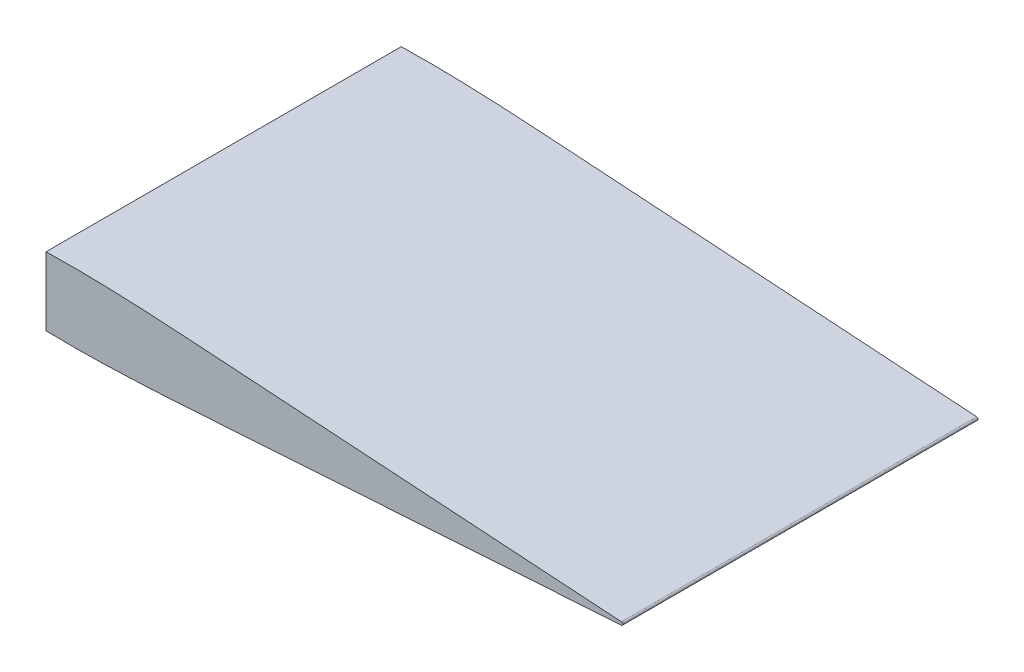
ISO-10303-21;
HEADER;
FILE_DESCRIPTION(('STEP AP214'),'2;1');
FILE_NAME('part.step','',(''),(''),'','','');
FILE_SCHEMA(('AUTOMOTIVE_DESIGN { 1 0 10303 214 1 1 1 1 }'));
ENDSEC;
DATA;
#1=APPLICATION_CONTEXT('core data for automotive mechanical design processes');
#2=APPLICATION_PROTOCOL_DEFINITION('international standard','automotive_design',2000,#1);
#3=PRODUCT_CONTEXT('',#1,'mechanical');
#4=PRODUCT('Part','Part','',(#3));
#5=PRODUCT_RELATED_PRODUCT_CATEGORY('part','',(#4));
#6=PRODUCT_DEFINITION_FORMATION('','',#4);
#7=PRODUCT_DEFINITION_CONTEXT('part definition',#1,'design');
#8=PRODUCT_DEFINITION('design','',#6,#7);
#9=PRODUCT_DEFINITION_SHAPE('','',#8);
#10=(LENGTH_UNIT() NAMED_UNIT(*) SI_UNIT(.MILLI.,.METRE.));
#11=(NAMED_UNIT(*) PLANE_ANGLE_UNIT() SI_UNIT($,.RADIAN.));
#12=(NAMED_UNIT(*) SI_UNIT($,.STERADIAN.) SOLID_ANGLE_UNIT());
#13=UNCERTAINTY_MEASURE_WITH_UNIT(LENGTH_MEASURE(1.E-05),#10,'distance_accuracy_value','');
#14=(GEOMETRIC_REPRESENTATION_CONTEXT(3) GLOBAL_UNCERTAINTY_ASSIGNED_CONTEXT((#13)) GLOBAL_UNIT_ASSIGNED_CONTEXT((#10,
#11,#12)) REPRESENTATION_CONTEXT('',''));
#15=CARTESIAN_POINT('',(0.,0.,0.));
#16=DIRECTION('',(0.,0.,1.));
#17=DIRECTION('',(1.,0.,0.));
#18=AXIS2_PLACEMENT_3D('',#15,#16,#17);
#19=CARTESIAN_POINT('',(57.0220913024489,21.1208734965673,-0.01000000000001));
#20=DIRECTION('',(-1.,0.,0.));
#21=DIRECTION('',(0.,0.,1.));
#22=AXIS2_PLACEMENT_3D('',#19,#20,#21);
#23=PLANE('',#22);
#24=DIRECTION('',(0.,-1.,0.));
#25=VECTOR('',#24,1.);
#26=CARTESIAN_POINT('',(57.0220913024489,-13.4640370754688,40.));
#27=LINE('',#26,#25);
#28=CARTESIAN_POINT('',(57.0220913024489,13.5359629245312,40.));
#29=VERTEX_POINT('',#28);
#30=CARTESIAN_POINT('',(57.0220913024489,-13.4640370754688,40.));
#31=VERTEX_POINT('',#30);
#32=EDGE_CURVE('E59',#29,#31,#27,.T.);
#33=ORIENTED_EDGE('',*,*,#32,.F.);
#34=DIRECTION('',(0.,0.,-1.));
#35=VECTOR('',#34,1.);
#36=CARTESIAN_POINT('',(57.0220913024489,13.5359629245312,40.));
#37=LINE('',#36,#35);
#38=CARTESIAN_POINT('',(57.0220913024489,13.5359629245312,110.));
#39=VERTEX_POINT('',#38);
#40=EDGE_CURVE('E201',#39,#29,#37,.T.);
#41=ORIENTED_EDGE('',*,*,#40,.F.);
#42=DIRECTION('',(0.,1.,0.));
#43=VECTOR('',#42,1.);
#44=CARTESIAN_POINT('',(57.0220913024489,-13.4640370754688,110.));
#45=LINE('',#44,#43);
#46=CARTESIAN_POINT('',(57.0220913024489,-13.4640370754688,110.));
#47=VERTEX_POINT('',#46);
#48=EDGE_CURVE('E205',#47,#39,#45,.T.);
#49=ORIENTED_EDGE('',*,*,#48,.F.);
#50=DIRECTION('',(0.,0.,1.));
#51=VECTOR('',#50,1.);
#52=CARTESIAN_POINT('',(57.0220913024489,-13.4640370754688,40.));
#53=LINE('',#52,#51);
#54=EDGE_CURVE('E214',#31,#47,#53,.T.);
#55=ORIENTED_EDGE('',*,*,#54,.F.);
#56=EDGE_LOOP('',(#33,#41,#49,#55));
#57=FACE_BOUND('',#56,.T.);
#58=DIRECTION('',(0.,-1.,0.));
#59=VECTOR('',#58,1.);
#60=CARTESIAN_POINT('',(57.0220913024489,2.03901631355602E-13,150.));
#61=LINE('',#60,#59);
#62=CARTESIAN_POINT('',(57.0220913112976,14.4496162845772,150.));
#63=VERTEX_POINT('',#62);
#64=CARTESIAN_POINT('',(57.0220913112977,-14.4496162845772,150.));
#65=VERTEX_POINT('',#64);
#66=EDGE_CURVE('E87',#63,#65,#61,.T.);
#67=ORIENTED_EDGE('',*,*,#66,.F.);
#68=DIRECTION('',(0.,0.,-1.));
#69=VECTOR('',#68,1.);
#70=CARTESIAN_POINT('',(57.0220913024489,14.4496162843662,150.));
#71=LINE('',#70,#69);
#72=CARTESIAN_POINT('',(57.0220913112976,14.4496162845772,0.));
#73=VERTEX_POINT('',#72);
#74=EDGE_CURVE('E108',#63,#73,#71,.T.);
#75=ORIENTED_EDGE('',*,*,#74,.T.);
#76=DIRECTION('',(0.,-1.,0.));
#77=VECTOR('',#76,1.);
#78=CARTESIAN_POINT('',(57.0220913024489,2.03901631355602E-13,0.));
#79=LINE('',#78,#77);
#80=CARTESIAN_POINT('',(57.0220913112977,-14.4496162845772,0.));
#81=VERTEX_POINT('',#80);
#82=EDGE_CURVE('E141',#73,#81,#79,.T.);
#83=ORIENTED_EDGE('',*,*,#82,.T.);
#84=DIRECTION('',(0.,0.,-1.));
#85=VECTOR('',#84,1.);
#86=CARTESIAN_POINT('',(57.0220913024489,-14.4496162843662,150.));
#87=LINE('',#86,#85);
#88=EDGE_CURVE('E149',#81,#65,#87,.F.);
#89=ORIENTED_EDGE('',*,*,#88,.T.);
#90=EDGE_LOOP('',(#67,#75,#83,#89));
#91=FACE_BOUND('',#90,.T.);
#92=ADVANCED_FACE('F41',(#57,#91),#23,.T.);
#93=CARTESIAN_POINT('',(300.,0.615,150.));
#94=CARTESIAN_POINT('',(297.904984083785,0.75175754308859,150.));
#95=CARTESIAN_POINT('',(292.317834146917,1.11647310076999,150.));
#96=CARTESIAN_POINT('',(283.239167485548,1.717548993117,150.));
#97=CARTESIAN_POINT('',(272.76385107331,2.40173412883395,150.));
#98=CARTESIAN_POINT('',(262.289009769235,3.09314837150869,150.));
#99=CARTESIAN_POINT('',(251.814135815064,3.78406655140474,150.));
#100=CARTESIAN_POINT('',(241.337843931188,4.46862529985887,150.));
#101=CARTESIAN_POINT('',(230.862161265605,5.16145375899976,150.));
#102=CARTESIAN_POINT('',(220.385838201456,5.84553816170969,150.));
#103=CARTESIAN_POINT('',(209.911154414138,6.53834924156426,150.));
#104=CARTESIAN_POINT('',(199.435845553229,7.22265025326787,150.));
#105=CARTESIAN_POINT('',(188.961161961777,7.91546436518573,150.));
#106=CARTESIAN_POINT('',(178.484838114123,8.59953663901671,150.));
#107=CARTESIAN_POINT('',(168.010154067309,9.29234472619852,150.));
#108=CARTESIAN_POINT('',(157.534847027507,9.97666983236351,150.));
#109=CARTESIAN_POINT('',(147.06015640951,10.6693905377389,150.));
#110=CARTESIAN_POINT('',(136.583858847943,11.3538123568298,150.));
#111=CARTESIAN_POINT('',(126.108081002565,12.0453815229781,150.));
#112=CARTESIAN_POINT('',(115.628989204461,12.7348475775842,150.));
#113=CARTESIAN_POINT('',(106.544413863488,13.3187717638727,150.));
#114=CARTESIAN_POINT('',(98.151476206991,13.7592616634662,150.));
#115=CARTESIAN_POINT('',(91.1565623688358,14.0750535449349,150.));
#116=CARTESIAN_POINT('',(83.4590911030426,14.3326710084469,150.));
#117=CARTESIAN_POINT('',(76.8097627687469,14.4942663264378,150.));
#118=CARTESIAN_POINT('',(71.208103954924,14.5530438963208,150.));
#119=CARTESIAN_POINT('',(68.0570107705436,14.5648415354949,150.));
#120=CARTESIAN_POINT('',(65.9559846118634,14.5661361460291,150.));
#121=CARTESIAN_POINT('',(63.5049428575731,14.5483076615896,150.));
#122=CARTESIAN_POINT('',(58.9501852432483,14.5072274097355,150.));
#123=CARTESIAN_POINT('',(52.6393729328738,14.3421780252763,150.));
#124=CARTESIAN_POINT('',(45.9763950033585,14.0411696911552,150.));
#125=CARTESIAN_POINT('',(40.7142788662388,13.6942708963401,150.));
#126=CARTESIAN_POINT('',(36.8531486122309,13.3715858694841,150.));
#127=CARTESIAN_POINT('',(33.6905280026766,13.0667563353647,150.));
#128=CARTESIAN_POINT('',(30.5256864431676,12.7135928826588,150.));
#129=CARTESIAN_POINT('',(27.3574246256501,12.304603807145,150.));
#130=CARTESIAN_POINT('',(23.8293477768756,11.7731450606675,150.));
#131=CARTESIAN_POINT('',(20.2934490427705,11.1558108117877,150.));
#132=CARTESIAN_POINT('',(16.7526134925339,10.4050388087684,150.));
#133=CARTESIAN_POINT('',(13.9101456800867,9.69526837778904,150.));
#134=CARTESIAN_POINT('',(11.411898728501,8.96894267593932,150.));
#135=CARTESIAN_POINT('',(9.247069544107,8.23912232844403,150.));
#136=CARTESIAN_POINT('',(7.0471016636079,7.37156353291515,150.));
#137=CARTESIAN_POINT('',(5.20436825337569,6.46929823591286,150.));
#138=CARTESIAN_POINT('',(3.70440686726622,5.56696021824286,150.));
#139=CARTESIAN_POINT('',(2.49240630636274,4.6717641181702,150.));
#140=CARTESIAN_POINT('',(0.823776107687222,3.08438944362807,150.));
#141=CARTESIAN_POINT('',(-0.563560510684523,0.,150.));
#142=CARTESIAN_POINT('',(0.823776107687273,-3.08438944362815,150.));
#143=CARTESIAN_POINT('',(2.49240630636272,-4.67176411817019,150.));
#144=CARTESIAN_POINT('',(3.70440686726622,-5.56696021824286,150.));
#145=CARTESIAN_POINT('',(5.20436825337569,-6.46929823591286,150.));
#146=CARTESIAN_POINT('',(7.04710166360792,-7.37156353291516,150.));
#147=CARTESIAN_POINT('',(9.24706954410698,-8.23912232844402,150.));
#148=CARTESIAN_POINT('',(11.411898728501,-8.96894267593932,150.));
#149=CARTESIAN_POINT('',(13.9101456800867,-9.69526837778906,150.));
#150=CARTESIAN_POINT('',(16.7526134925338,-10.4050388087684,150.));
#151=CARTESIAN_POINT('',(20.2934490427705,-11.1558108117877,150.));
#152=CARTESIAN_POINT('',(23.8293477768757,-11.7731450606675,150.));
#153=CARTESIAN_POINT('',(27.35742462565,-12.304603807145,150.));
#154=CARTESIAN_POINT('',(30.5256864431676,-12.7135928826588,150.));
#155=CARTESIAN_POINT('',(33.6905280026766,-13.0667563353647,150.));
#156=CARTESIAN_POINT('',(36.8531486122309,-13.3715858694841,150.));
#157=CARTESIAN_POINT('',(40.7142788662388,-13.6942708963401,150.));
#158=CARTESIAN_POINT('',(45.9763950033586,-14.0411696911552,150.));
#159=CARTESIAN_POINT('',(52.6393729328738,-14.3421780252763,150.));
#160=CARTESIAN_POINT('',(58.9501852432483,-14.5072274097355,150.));
#161=CARTESIAN_POINT('',(63.5049428575731,-14.5483076615896,150.));
#162=CARTESIAN_POINT('',(65.9559846118633,-14.5661361460291,150.));
#163=CARTESIAN_POINT('',(68.0570107705436,-14.5648415354949,150.));
#164=CARTESIAN_POINT('',(71.208103954924,-14.5530438963208,150.));
#165=CARTESIAN_POINT('',(76.8097627687469,-14.4942663264378,150.));
#166=CARTESIAN_POINT('',(83.4590911030426,-14.3326710084469,150.));
#167=CARTESIAN_POINT('',(91.1565623688358,-14.0750535449349,150.));
#168=CARTESIAN_POINT('',(98.151476206991,-13.7592616634662,150.));
#169=CARTESIAN_POINT('',(106.544413863488,-13.3187717638727,150.));
#170=CARTESIAN_POINT('',(115.628989204461,-12.7348475775842,150.));
#171=CARTESIAN_POINT('',(126.108081002565,-12.0453815229782,150.));
#172=CARTESIAN_POINT('',(136.583858847943,-11.3538123568298,150.));
#173=CARTESIAN_POINT('',(147.06015640951,-10.6693905377389,150.));
#174=CARTESIAN_POINT('',(157.534847027507,-9.97666983236352,150.));
#175=CARTESIAN_POINT('',(168.010154067309,-9.29234472619851,150.));
#176=CARTESIAN_POINT('',(178.484838114123,-8.59953663901672,150.));
#177=CARTESIAN_POINT('',(188.961161961777,-7.91546436518573,150.));
#178=CARTESIAN_POINT('',(199.435845553229,-7.22265025326786,150.));
#179=CARTESIAN_POINT('',(209.911154414138,-6.53834924156426,150.));
#180=CARTESIAN_POINT('',(220.385838201456,-5.84553816170969,150.));
#181=CARTESIAN_POINT('',(230.862161265605,-5.16145375899976,150.));
#182=CARTESIAN_POINT('',(241.337843931188,-4.46862529985887,150.));
#183=CARTESIAN_POINT('',(251.814135815064,-3.78406655140474,150.));
#184=CARTESIAN_POINT('',(262.289009769236,-3.09314837150869,150.));
#185=CARTESIAN_POINT('',(272.76385107331,-2.40173412883395,150.));
#186=CARTESIAN_POINT('',(283.239167485548,-1.71754899311699,150.));
#187=CARTESIAN_POINT('',(292.317834146917,-1.11647310077,150.));
#188=CARTESIAN_POINT('',(297.904984083785,-0.75175754308859,150.));
#189=CARTESIAN_POINT('',(300.,-0.615,150.));
#190=B_SPLINE_CURVE_WITH_KNOTS('',3,(#93,#94,#95,#96,#97,#98,#99,#100,#101,#102,#103,#104,#105,
#106,#107,#108,#109,#110,#111,#112,#113,#114,#115,#116,#117,#118,#119,#120,#121,#122,#123,#124,
#125,#126,#127,#128,#129,#130,#131,#132,#133,#134,#135,#136,#137,#138,#139,#140,#141,#142,#143,
#144,#145,#146,#147,#148,#149,#150,#151,#152,#153,#154,#155,#156,#157,#158,#159,#160,#161,#162,
#163,#164,#165,#166,#167,#168,#169,#170,#171,#172,#173,#174,#175,#176,#177,#178,#179,#180,#181,
#182,#183,#184,#185,#186,#187,#188,#189),.UNSPECIFIED.,.F.,.F.,(4,1,1,1,1,1,1,1,1,1,1,1,1,1,1,1,
1,1,1,1,1,1,1,1,1,1,1,1,1,1,1,1,1,1,1,1,1,1,1,1,1,1,1,1,1,1,1,1,1,1,1,1,1,1,1,1,1,1,1,1,1,1,1,1,
1,1,1,1,1,1,1,1,1,1,1,1,1,1,1,1,1,1,1,1,1,1,1,1,1,1,1,1,1,1,4),(0.,0.0103317667258092,
0.0275535519148415,0.0447750143759933,0.0619918890878921,0.0792136742769245,0.0964351367380763,
0.113656921927109,0.13087838438826,0.148100169577293,0.165316721469263,0.182538506658296,
0.199759969119447,0.21698175430848,0.23419830620045,0.251420091389483,0.268641553850634,
0.285863339039667,0.303084801500818,0.320322147091687,0.330661096781363,0.344443905301423,
0.354779243630488,0.368562091684667,0.377174559088726,0.382346693571461,0.384069085539591,
0.387513925716762,0.394408809862741,0.406484297575228,0.418578438098915,0.427229264414947,
0.432434171748687,0.437645263639366,0.442864528340028,0.448104781667718,0.453364927121588,
0.460421620890769,0.465764878525566,0.47117403778509,0.474835155867093,0.478565393973049,
0.482412614605373,0.486466494475071,0.488643966308192,0.49102188077919,0.493857902158305,0.5,
0.506142097841696,0.50897811922081,0.511356033691808,0.513533505524929,0.517587385394628,
0.521434606026952,0.525164844132907,0.52882596221491,0.534235121474435,0.539578379109231,
0.546635072878412,0.551895218332282,0.557135471659973,0.562354736360635,0.567565828251314,
0.572770735585054,0.581421561901085,0.593515702424773,0.605591190137259,0.612486074283239,
0.615930914460409,0.617653306428539,0.622825440911274,0.631437908315334,0.645220756369513,
0.655556094698577,0.669338903218637,0.679677852908314,0.696915198499182,0.714136660960334,
0.731358446149366,0.748579908610518,0.76580169379955,0.783018245691521,0.800240030880553,
0.817461493341705,0.834683278530737,0.851899830422708,0.86912161561174,0.886343078072892,
0.903564863261924,0.920786325723076,0.938008110912108,0.955224985624007,0.972446448085159,
0.989668233274191,1.),.UNSPECIFIED.);
#191=DIRECTION('',(0.,0.,-1.));
#192=VECTOR('',#191,1.);
#193=SURFACE_OF_LINEAR_EXTRUSION('',#190,#192);
#194=ORIENTED_EDGE('',*,*,#74,.F.);
#195=CARTESIAN_POINT('',(300.,0.615,150.));
#196=VERTEX_POINT('',#195);
#197=EDGE_CURVE('E91',#196,#63,#190,.T.);
#198=ORIENTED_EDGE('',*,*,#197,.F.);
#199=DIRECTION('',(0.,0.,-1.));
#200=VECTOR('',#199,1.);
#201=CARTESIAN_POINT('',(300.,0.615,150.));
#202=LINE('',#201,#200);
#203=CARTESIAN_POINT('',(300.,0.615,0.));
#204=VERTEX_POINT('',#203);
#205=EDGE_CURVE('E98',#196,#204,#202,.T.);
#206=ORIENTED_EDGE('',*,*,#205,.T.);
#207=CARTESIAN_POINT('',(300.,0.615,0.));
#208=CARTESIAN_POINT('',(297.904984083785,0.75175754308859,0.));
#209=CARTESIAN_POINT('',(292.317834146917,1.11647310076999,0.));
#210=CARTESIAN_POINT('',(283.239167485548,1.717548993117,0.));
#211=CARTESIAN_POINT('',(272.76385107331,2.40173412883395,0.));
#212=CARTESIAN_POINT('',(262.289009769235,3.09314837150869,0.));
#213=CARTESIAN_POINT('',(251.814135815064,3.78406655140474,0.));
#214=CARTESIAN_POINT('',(241.337843931188,4.46862529985887,0.));
#215=CARTESIAN_POINT('',(230.862161265605,5.16145375899976,0.));
#216=CARTESIAN_POINT('',(220.385838201456,5.84553816170969,0.));
#217=CARTESIAN_POINT('',(209.911154414138,6.53834924156426,0.));
#218=CARTESIAN_POINT('',(199.435845553229,7.22265025326787,0.));
#219=CARTESIAN_POINT('',(188.961161961777,7.91546436518573,0.));
#220=CARTESIAN_POINT('',(178.484838114123,8.59953663901671,0.));
#221=CARTESIAN_POINT('',(168.010154067309,9.29234472619852,0.));
#222=CARTESIAN_POINT('',(157.534847027507,9.97666983236351,0.));
#223=CARTESIAN_POINT('',(147.06015640951,10.6693905377389,0.));
#224=CARTESIAN_POINT('',(136.583858847943,11.3538123568298,0.));
#225=CARTESIAN_POINT('',(126.108081002565,12.0453815229781,0.));
#226=CARTESIAN_POINT('',(115.628989204461,12.7348475775842,0.));
#227=CARTESIAN_POINT('',(106.544413863488,13.3187717638727,0.));
#228=CARTESIAN_POINT('',(98.151476206991,13.7592616634662,0.));
#229=CARTESIAN_POINT('',(91.1565623688358,14.0750535449349,0.));
#230=CARTESIAN_POINT('',(83.4590911030426,14.3326710084469,0.));
#231=CARTESIAN_POINT('',(76.8097627687469,14.4942663264378,0.));
#232=CARTESIAN_POINT('',(71.208103954924,14.5530438963208,0.));
#233=CARTESIAN_POINT('',(68.0570107705436,14.5648415354949,0.));
#234=CARTESIAN_POINT('',(65.9559846118634,14.5661361460291,0.));
#235=CARTESIAN_POINT('',(63.5049428575731,14.5483076615896,0.));
#236=CARTESIAN_POINT('',(58.9501852432483,14.5072274097355,0.));
#237=CARTESIAN_POINT('',(52.6393729328738,14.3421780252763,0.));
#238=CARTESIAN_POINT('',(45.9763950033585,14.0411696911552,0.));
#239=CARTESIAN_POINT('',(40.7142788662388,13.6942708963401,0.));
#240=CARTESIAN_POINT('',(36.8531486122309,13.3715858694841,0.));
#241=CARTESIAN_POINT('',(33.6905280026766,13.0667563353647,0.));
#242=CARTESIAN_POINT('',(30.5256864431676,12.7135928826588,0.));
#243=CARTESIAN_POINT('',(27.3574246256501,12.304603807145,0.));
#244=CARTESIAN_POINT('',(23.8293477768756,11.7731450606675,0.));
#245=CARTESIAN_POINT('',(20.2934490427705,11.1558108117877,0.));
#246=CARTESIAN_POINT('',(16.7526134925339,10.4050388087684,0.));
#247=CARTESIAN_POINT('',(13.9101456800867,9.69526837778904,0.));
#248=CARTESIAN_POINT('',(11.411898728501,8.96894267593932,0.));
#249=CARTESIAN_POINT('',(9.247069544107,8.23912232844403,0.));
#250=CARTESIAN_POINT('',(7.0471016636079,7.37156353291515,0.));
#251=CARTESIAN_POINT('',(5.20436825337569,6.46929823591286,0.));
#252=CARTESIAN_POINT('',(3.70440686726622,5.56696021824286,0.));
#253=CARTESIAN_POINT('',(2.49240630636274,4.6717641181702,0.));
#254=CARTESIAN_POINT('',(0.823776107687222,3.08438944362807,0.));
#255=CARTESIAN_POINT('',(-0.563560510684523,0.,0.));
#256=CARTESIAN_POINT('',(0.823776107687273,-3.08438944362815,0.));
#257=CARTESIAN_POINT('',(2.49240630636272,-4.67176411817019,0.));
#258=CARTESIAN_POINT('',(3.70440686726622,-5.56696021824286,0.));
#259=CARTESIAN_POINT('',(5.20436825337569,-6.46929823591286,0.));
#260=CARTESIAN_POINT('',(7.04710166360792,-7.37156353291516,0.));
#261=CARTESIAN_POINT('',(9.24706954410698,-8.23912232844402,0.));
#262=CARTESIAN_POINT('',(11.411898728501,-8.96894267593932,0.));
#263=CARTESIAN_POINT('',(13.9101456800867,-9.69526837778906,0.));
#264=CARTESIAN_POINT('',(16.7526134925338,-10.4050388087684,0.));
#265=CARTESIAN_POINT('',(20.2934490427705,-11.1558108117877,0.));
#266=CARTESIAN_POINT('',(23.8293477768757,-11.7731450606675,0.));
#267=CARTESIAN_POINT('',(27.35742462565,-12.304603807145,0.));
#268=CARTESIAN_POINT('',(30.5256864431676,-12.7135928826588,0.));
#269=CARTESIAN_POINT('',(33.6905280026766,-13.0667563353647,0.));
#270=CARTESIAN_POINT('',(36.8531486122309,-13.3715858694841,0.));
#271=CARTESIAN_POINT('',(40.7142788662388,-13.6942708963401,0.));
#272=CARTESIAN_POINT('',(45.9763950033586,-14.0411696911552,0.));
#273=CARTESIAN_POINT('',(52.6393729328738,-14.3421780252763,0.));
#274=CARTESIAN_POINT('',(58.9501852432483,-14.5072274097355,0.));
#275=CARTESIAN_POINT('',(63.5049428575731,-14.5483076615896,0.));
#276=CARTESIAN_POINT('',(65.9559846118633,-14.5661361460291,0.));
#277=CARTESIAN_POINT('',(68.0570107705436,-14.5648415354949,0.));
#278=CARTESIAN_POINT('',(71.208103954924,-14.5530438963208,0.));
#279=CARTESIAN_POINT('',(76.8097627687469,-14.4942663264378,0.));
#280=CARTESIAN_POINT('',(83.4590911030426,-14.3326710084469,0.));
#281=CARTESIAN_POINT('',(91.1565623688358,-14.0750535449349,0.));
#282=CARTESIAN_POINT('',(98.151476206991,-13.7592616634662,0.));
#283=CARTESIAN_POINT('',(106.544413863488,-13.3187717638727,0.));
#284=CARTESIAN_POINT('',(115.628989204461,-12.7348475775842,0.));
#285=CARTESIAN_POINT('',(126.108081002565,-12.0453815229782,0.));
#286=CARTESIAN_POINT('',(136.583858847943,-11.3538123568298,0.));
#287=CARTESIAN_POINT('',(147.06015640951,-10.6693905377389,0.));
#288=CARTESIAN_POINT('',(157.534847027507,-9.97666983236352,0.));
#289=CARTESIAN_POINT('',(168.010154067309,-9.29234472619851,0.));
#290=CARTESIAN_POINT('',(178.484838114123,-8.59953663901672,0.));
#291=CARTESIAN_POINT('',(188.961161961777,-7.91546436518573,0.));
#292=CARTESIAN_POINT('',(199.435845553229,-7.22265025326786,0.));
#293=CARTESIAN_POINT('',(209.911154414138,-6.53834924156426,0.));
#294=CARTESIAN_POINT('',(220.385838201456,-5.84553816170969,0.));
#295=CARTESIAN_POINT('',(230.862161265605,-5.16145375899976,0.));
#296=CARTESIAN_POINT('',(241.337843931188,-4.46862529985887,0.));
#297=CARTESIAN_POINT('',(251.814135815064,-3.78406655140474,0.));
#298=CARTESIAN_POINT('',(262.289009769236,-3.09314837150869,0.));
#299=CARTESIAN_POINT('',(272.76385107331,-2.40173412883395,0.));
#300=CARTESIAN_POINT('',(283.239167485548,-1.71754899311699,0.));
#301=CARTESIAN_POINT('',(292.317834146917,-1.11647310077,0.));
#302=CARTESIAN_POINT('',(297.904984083785,-0.75175754308859,0.));
#303=CARTESIAN_POINT('',(300.,-0.615,0.));
#304=B_SPLINE_CURVE_WITH_KNOTS('',3,(#207,#208,#209,#210,#211,#212,#213,#214,#215,#216,#217,
#218,#219,#220,#221,#222,#223,#224,#225,#226,#227,#228,#229,#230,#231,#232,#233,#234,#235,#236,
#237,#238,#239,#240,#241,#242,#243,#244,#245,#246,#247,#248,#249,#250,#251,#252,#253,#254,#255,
#256,#257,#258,#259,#260,#261,#262,#263,#264,#265,#266,#267,#268,#269,#270,#271,#272,#273,#274,
#275,#276,#277,#278,#279,#280,#281,#282,#283,#284,#285,#286,#287,#288,#289,#290,#291,#292,#293,
#294,#295,#296,#297,#298,#299,#300,#301,#302,#303),.UNSPECIFIED.,.F.,.F.,(4,1,1,1,1,1,1,1,1,1,1,
1,1,1,1,1,1,1,1,1,1,1,1,1,1,1,1,1,1,1,1,1,1,1,1,1,1,1,1,1,1,1,1,1,1,1,1,1,1,1,1,1,1,1,1,1,1,1,1,
1,1,1,1,1,1,1,1,1,1,1,1,1,1,1,1,1,1,1,1,1,1,1,1,1,1,1,1,1,1,1,1,1,1,1,4),(0.,0.0103317667258092,
0.0275535519148415,0.0447750143759933,0.0619918890878921,0.0792136742769245,0.0964351367380763,
0.113656921927109,0.13087838438826,0.148100169577293,0.165316721469263,0.182538506658296,
0.199759969119447,0.21698175430848,0.23419830620045,0.251420091389483,0.268641553850634,
0.285863339039667,0.303084801500818,0.320322147091687,0.330661096781363,0.344443905301423,
0.354779243630488,0.368562091684667,0.377174559088726,0.382346693571461,0.384069085539591,
0.387513925716762,0.394408809862741,0.406484297575228,0.418578438098915,0.427229264414947,
0.432434171748687,0.437645263639366,0.442864528340028,0.448104781667718,0.453364927121588,
0.460421620890769,0.465764878525566,0.47117403778509,0.474835155867093,0.478565393973049,
0.482412614605373,0.486466494475071,0.488643966308192,0.49102188077919,0.493857902158305,0.5,
0.506142097841696,0.50897811922081,0.511356033691808,0.513533505524929,0.517587385394628,
0.521434606026952,0.525164844132907,0.52882596221491,0.534235121474435,0.539578379109231,
0.546635072878412,0.551895218332282,0.557135471659973,0.562354736360635,0.567565828251314,
0.572770735585054,0.581421561901085,0.593515702424773,0.605591190137259,0.612486074283239,
0.615930914460409,0.617653306428539,0.622825440911274,0.631437908315334,0.645220756369513,
0.655556094698577,0.669338903218637,0.679677852908314,0.696915198499182,0.714136660960334,
0.731358446149366,0.748579908610518,0.76580169379955,0.783018245691521,0.800240030880553,
0.817461493341705,0.834683278530737,0.851899830422708,0.86912161561174,0.886343078072892,
0.903564863261924,0.920786325723076,0.938008110912108,0.955224985624007,0.972446448085159,
0.989668233274191,1.),.UNSPECIFIED.);
#305=EDGE_CURVE('E45',#204,#73,#304,.T.);
#306=ORIENTED_EDGE('',*,*,#305,.T.);
#307=EDGE_LOOP('',(#194,#198,#206,#306));
#308=FACE_BOUND('',#307,.T.);
#309=ADVANCED_FACE('F124',(#308),#193,.F.);
#310=ORIENTED_EDGE('',*,*,#88,.F.);
#311=CARTESIAN_POINT('',(300.,-0.615,0.));
#312=VERTEX_POINT('',#311);
#313=EDGE_CURVE('E11',#81,#312,#304,.T.);
#314=ORIENTED_EDGE('',*,*,#313,.T.);
#315=DIRECTION('',(0.,0.,-1.));
#316=VECTOR('',#315,1.);
#317=CARTESIAN_POINT('',(300.,-0.615,150.));
#318=LINE('',#317,#316);
#319=CARTESIAN_POINT('',(300.,-0.615,150.));
#320=VERTEX_POINT('',#319);
#321=EDGE_CURVE('E96',#320,#312,#318,.T.);
#322=ORIENTED_EDGE('',*,*,#321,.F.);
#323=EDGE_CURVE('E80',#65,#320,#190,.T.);
#324=ORIENTED_EDGE('',*,*,#323,.F.);
#325=EDGE_LOOP('',(#310,#314,#322,#324));
#326=FACE_BOUND('',#325,.T.);
#327=ADVANCED_FACE('F102',(#326),#193,.F.);
#328=CARTESIAN_POINT('',(0.,2.03901631355602E-13,150.));
#329=DIRECTION('',(0.,0.,1.));
#330=DIRECTION('',(1.,0.,0.));
#331=AXIS2_PLACEMENT_3D('',#328,#329,#330);
#332=PLANE('',#331);
#333=ORIENTED_EDGE('',*,*,#197,.T.);
#334=ORIENTED_EDGE('',*,*,#66,.T.);
#335=ORIENTED_EDGE('',*,*,#323,.T.);
#336=CARTESIAN_POINT('',(299.959854295928,0.,150.));
#337=DIRECTION('',(0.,0.,1.));
#338=DIRECTION('',(-1.,0.,0.));
#339=AXIS2_PLACEMENT_3D('',#336,#337,#338);
#340=CIRCLE('',#339,0.616308914064589);
#341=EDGE_CURVE('E83',#320,#196,#340,.T.);
#342=ORIENTED_EDGE('',*,*,#341,.T.);
#343=EDGE_LOOP('',(#333,#334,#335,#342));
#344=FACE_BOUND('',#343,.T.);
#345=ADVANCED_FACE('F43',(#344),#332,.T.);
#346=CARTESIAN_POINT('',(0.,2.03901631355602E-13,0.));
#347=DIRECTION('',(0.,0.,1.));
#348=DIRECTION('',(1.,0.,0.));
#349=AXIS2_PLACEMENT_3D('',#346,#347,#348);
#350=PLANE('',#349);
#351=ORIENTED_EDGE('',*,*,#82,.F.);
#352=ORIENTED_EDGE('',*,*,#305,.F.);
#353=CARTESIAN_POINT('',(299.959854295928,0.,0.));
#354=DIRECTION('',(0.,0.,1.));
#355=DIRECTION('',(-1.,0.,0.));
#356=AXIS2_PLACEMENT_3D('',#353,#354,#355);
#357=CIRCLE('',#356,0.616308914064589);
#358=EDGE_CURVE('E90',#312,#204,#357,.T.);
#359=ORIENTED_EDGE('',*,*,#358,.F.);
#360=ORIENTED_EDGE('',*,*,#313,.F.);
#361=EDGE_LOOP('',(#351,#352,#359,#360));
#362=FACE_BOUND('',#361,.T.);
#363=ADVANCED_FACE('F129',(#362),#350,.F.);
#364=CARTESIAN_POINT('',(299.959854295928,0.,150.));
#365=DIRECTION('',(0.,0.,-1.));
#366=DIRECTION('',(-1.,0.,0.));
#367=AXIS2_PLACEMENT_3D('',#364,#365,#366);
#368=CYLINDRICAL_SURFACE('',#367,0.616308914064589);
#369=ORIENTED_EDGE('',*,*,#358,.T.);
#370=ORIENTED_EDGE('',*,*,#205,.F.);
#371=ORIENTED_EDGE('',*,*,#341,.F.);
#372=ORIENTED_EDGE('',*,*,#321,.T.);
#373=EDGE_LOOP('',(#369,#370,#371,#372));
#374=FACE_BOUND('',#373,.T.);
#375=ADVANCED_FACE('F95',(#374),#368,.T.);
#376=CARTESIAN_POINT('',(77.0220913024489,-13.4640370754688,40.));
#377=DIRECTION('',(0.,0.,-1.));
#378=DIRECTION('',(-1.,0.,0.));
#379=AXIS2_PLACEMENT_3D('',#376,#377,#378);
#380=PLANE('',#379);
#381=ORIENTED_EDGE('',*,*,#32,.T.);
#382=DIRECTION('',(-1.,0.,0.));
#383=VECTOR('',#382,1.);
#384=CARTESIAN_POINT('',(77.0220913024489,-13.4640370754688,40.));
#385=LINE('',#384,#383);
#386=CARTESIAN_POINT('',(77.0220913024489,-13.4640370754688,40.));
#387=VERTEX_POINT('',#386);
#388=EDGE_CURVE('E111',#387,#31,#385,.T.);
#389=ORIENTED_EDGE('',*,*,#388,.F.);
#390=DIRECTION('',(0.,-1.,0.));
#391=VECTOR('',#390,1.);
#392=CARTESIAN_POINT('',(77.0220913024489,-13.4640370754688,40.));
#393=LINE('',#392,#391);
#394=CARTESIAN_POINT('',(77.0220913024489,13.5359629245312,40.));
#395=VERTEX_POINT('',#394);
#396=EDGE_CURVE('E181',#395,#387,#393,.T.);
#397=ORIENTED_EDGE('',*,*,#396,.F.);
#398=DIRECTION('',(-1.,0.,0.));
#399=VECTOR('',#398,1.);
#400=CARTESIAN_POINT('',(77.0220913024489,13.5359629245312,40.));
#401=LINE('',#400,#399);
#402=EDGE_CURVE('E150',#395,#29,#401,.T.);
#403=ORIENTED_EDGE('',*,*,#402,.T.);
#404=EDGE_LOOP('',(#381,#389,#397,#403));
#405=FACE_BOUND('',#404,.T.);
#406=ADVANCED_FACE('F136',(#405),#380,.F.);
#407=CARTESIAN_POINT('',(77.0220913024489,13.5359629245312,40.));
#408=DIRECTION('',(0.,1.,0.));
#409=DIRECTION('',(0.,0.,1.));
#410=AXIS2_PLACEMENT_3D('',#407,#408,#409);
#411=PLANE('',#410);
#412=ORIENTED_EDGE('',*,*,#40,.T.);
#413=ORIENTED_EDGE('',*,*,#402,.F.);
#414=DIRECTION('',(0.,0.,-1.));
#415=VECTOR('',#414,1.);
#416=CARTESIAN_POINT('',(77.0220913024489,13.5359629245312,40.));
#417=LINE('',#416,#415);
#418=CARTESIAN_POINT('',(77.0220913024489,13.5359629245312,110.));
#419=VERTEX_POINT('',#418);
#420=EDGE_CURVE('E188',#419,#395,#417,.T.);
#421=ORIENTED_EDGE('',*,*,#420,.F.);
#422=DIRECTION('',(-1.,0.,0.));
#423=VECTOR('',#422,1.);
#424=CARTESIAN_POINT('',(77.0220913024489,13.5359629245312,110.));
#425=LINE('',#424,#423);
#426=EDGE_CURVE('E154',#419,#39,#425,.T.);
#427=ORIENTED_EDGE('',*,*,#426,.T.);
#428=EDGE_LOOP('',(#412,#413,#421,#427));
#429=FACE_BOUND('',#428,.T.);
#430=ADVANCED_FACE('F228',(#429),#411,.F.);
#431=CARTESIAN_POINT('',(77.0220913024489,-13.4640370754688,110.));
#432=DIRECTION('',(0.,0.,1.));
#433=DIRECTION('',(1.,0.,0.));
#434=AXIS2_PLACEMENT_3D('',#431,#432,#433);
#435=PLANE('',#434);
#436=ORIENTED_EDGE('',*,*,#48,.T.);
#437=ORIENTED_EDGE('',*,*,#426,.F.);
#438=DIRECTION('',(0.,1.,0.));
#439=VECTOR('',#438,1.);
#440=CARTESIAN_POINT('',(77.0220913024489,-13.4640370754688,110.));
#441=LINE('',#440,#439);
#442=CARTESIAN_POINT('',(77.0220913024489,-13.4640370754688,110.));
#443=VERTEX_POINT('',#442);
#444=EDGE_CURVE('E196',#443,#419,#441,.T.);
#445=ORIENTED_EDGE('',*,*,#444,.F.);
#446=DIRECTION('',(-1.,0.,0.));
#447=VECTOR('',#446,1.);
#448=CARTESIAN_POINT('',(77.0220913024489,-13.4640370754688,110.));
#449=LINE('',#448,#447);
#450=EDGE_CURVE('E187',#443,#47,#449,.T.);
#451=ORIENTED_EDGE('',*,*,#450,.T.);
#452=EDGE_LOOP('',(#436,#437,#445,#451));
#453=FACE_BOUND('',#452,.T.);
#454=ADVANCED_FACE('F223',(#453),#435,.F.);
#455=CARTESIAN_POINT('',(77.0220913024489,-13.4640370754688,40.));
#456=DIRECTION('',(0.,-1.,0.));
#457=DIRECTION('',(0.,0.,-1.));
#458=AXIS2_PLACEMENT_3D('',#455,#456,#457);
#459=PLANE('',#458);
#460=ORIENTED_EDGE('',*,*,#54,.T.);
#461=ORIENTED_EDGE('',*,*,#450,.F.);
#462=DIRECTION('',(0.,0.,1.));
#463=VECTOR('',#462,1.);
#464=CARTESIAN_POINT('',(77.0220913024489,-13.4640370754688,40.));
#465=LINE('',#464,#463);
#466=EDGE_CURVE('E190',#387,#443,#465,.T.);
#467=ORIENTED_EDGE('',*,*,#466,.F.);
#468=ORIENTED_EDGE('',*,*,#388,.T.);
#469=EDGE_LOOP('',(#460,#461,#467,#468));
#470=FACE_BOUND('',#469,.T.);
#471=ADVANCED_FACE('F191',(#470),#459,.F.);
#472=CARTESIAN_POINT('',(77.0220913024489,0.,0.));
#473=DIRECTION('',(1.,0.,0.));
#474=DIRECTION('',(0.,0.,-1.));
#475=AXIS2_PLACEMENT_3D('',#472,#473,#474);
#476=PLANE('',#475);
#477=ORIENTED_EDGE('',*,*,#396,.T.);
#478=ORIENTED_EDGE('',*,*,#466,.T.);
#479=ORIENTED_EDGE('',*,*,#444,.T.);
#480=ORIENTED_EDGE('',*,*,#420,.T.);
#481=EDGE_LOOP('',(#477,#478,#479,#480));
#482=FACE_BOUND('',#481,.T.);
#483=ADVANCED_FACE('F198',(#482),#476,.F.);
#484=CLOSED_SHELL('',(#92,#309,#327,#345,#363,#375,#406,#430,#454,#471,#483));
#485=MANIFOLD_SOLID_BREP('B2',#484);
#486=ADVANCED_BREP_SHAPE_REPRESENTATION('',(#18,#485),#14);
#487=SHAPE_DEFINITION_REPRESENTATION(#9,#486);
ENDSEC;
END-ISO-10303-21;
